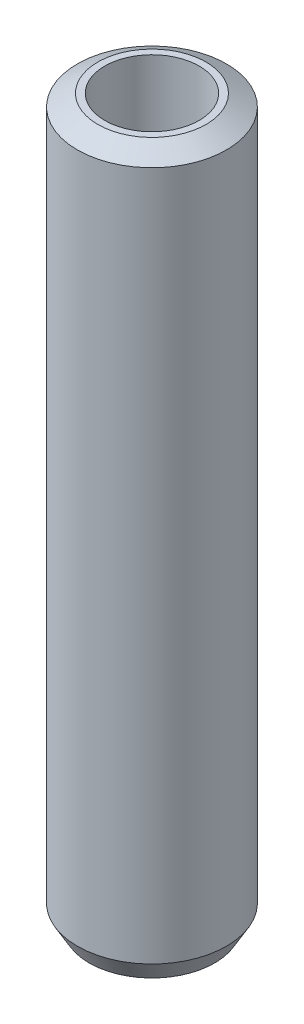
ISO-10303-21;
HEADER;
FILE_DESCRIPTION(('STEP AP214'),'2;1');
FILE_NAME('part.step','',(''),(''),'','','');
FILE_SCHEMA(('AUTOMOTIVE_DESIGN { 1 0 10303 214 1 1 1 1 }'));
ENDSEC;
DATA;
#1=APPLICATION_CONTEXT('core data for automotive mechanical design processes');
#2=APPLICATION_PROTOCOL_DEFINITION('international standard','automotive_design',2000,#1);
#3=PRODUCT_CONTEXT('',#1,'mechanical');
#4=PRODUCT('Part','Part','',(#3));
#5=PRODUCT_RELATED_PRODUCT_CATEGORY('part','',(#4));
#6=PRODUCT_DEFINITION_FORMATION('','',#4);
#7=PRODUCT_DEFINITION_CONTEXT('part definition',#1,'design');
#8=PRODUCT_DEFINITION('design','',#6,#7);
#9=PRODUCT_DEFINITION_SHAPE('','',#8);
#10=(LENGTH_UNIT() NAMED_UNIT(*) SI_UNIT(.MILLI.,.METRE.));
#11=(NAMED_UNIT(*) PLANE_ANGLE_UNIT() SI_UNIT($,.RADIAN.));
#12=(NAMED_UNIT(*) SI_UNIT($,.STERADIAN.) SOLID_ANGLE_UNIT());
#13=UNCERTAINTY_MEASURE_WITH_UNIT(LENGTH_MEASURE(1.E-05),#10,'distance_accuracy_value','');
#14=(GEOMETRIC_REPRESENTATION_CONTEXT(3) GLOBAL_UNCERTAINTY_ASSIGNED_CONTEXT((#13)) GLOBAL_UNIT_ASSIGNED_CONTEXT((#10,
#11,#12)) REPRESENTATION_CONTEXT('',''));
#15=CARTESIAN_POINT('',(0.,0.,0.));
#16=DIRECTION('',(0.,0.,1.));
#17=DIRECTION('',(1.,0.,0.));
#18=AXIS2_PLACEMENT_3D('',#15,#16,#17);
#19=CARTESIAN_POINT('',(0.,217.803175001456,0.));
#20=DIRECTION('',(0.,-1.,0.));
#21=DIRECTION('',(0.,0.,-1.));
#22=AXIS2_PLACEMENT_3D('',#19,#20,#21);
#23=CYLINDRICAL_SURFACE('',#22,22.5);
#24=CARTESIAN_POINT('',(0.,214.238775791943,0.));
#25=DIRECTION('',(0.,1.,0.));
#26=DIRECTION('',(0.,0.,1.));
#27=AXIS2_PLACEMENT_3D('',#24,#25,#26);
#28=CIRCLE('',#27,22.5);
#29=CARTESIAN_POINT('',(0.,214.238775791943,22.5));
#30=VERTEX_POINT('',#29);
#31=EDGE_CURVE('E50',#30,#30,#28,.F.);
#32=ORIENTED_EDGE('',*,*,#31,.T.);
#33=EDGE_LOOP('',(#32));
#34=FACE_BOUND('',#33,.T.);
#35=CARTESIAN_POINT('',(0.,6.17372052933607,0.));
#36=DIRECTION('',(0.,1.,0.));
#37=DIRECTION('',(0.,0.,1.));
#38=AXIS2_PLACEMENT_3D('',#35,#36,#37);
#39=CIRCLE('',#38,22.5);
#40=CARTESIAN_POINT('',(0.,6.17372052933607,22.5));
#41=VERTEX_POINT('',#40);
#42=EDGE_CURVE('E51',#41,#41,#39,.T.);
#43=ORIENTED_EDGE('',*,*,#42,.T.);
#44=EDGE_LOOP('',(#43));
#45=FACE_BOUND('',#44,.T.);
#46=ADVANCED_FACE('F39',(#34,#45),#23,.T.);
#47=CARTESIAN_POINT('',(0.,217.803175001456,0.));
#48=DIRECTION('',(0.,1.,0.));
#49=DIRECTION('',(0.,0.,1.));
#50=AXIS2_PLACEMENT_3D('',#47,#48,#49);
#51=PLANE('',#50);
#52=CARTESIAN_POINT('',(0.,217.803175001456,0.));
#53=DIRECTION('',(0.,1.,0.));
#54=DIRECTION('',(0.,0.,1.));
#55=AXIS2_PLACEMENT_3D('',#52,#53,#54);
#56=CIRCLE('',#55,16.326279470664);
#57=CARTESIAN_POINT('',(0.,217.803175001456,16.326279470664));
#58=VERTEX_POINT('',#57);
#59=EDGE_CURVE('E54',#58,#58,#56,.T.);
#60=ORIENTED_EDGE('',*,*,#59,.T.);
#61=EDGE_LOOP('',(#60));
#62=FACE_BOUND('',#61,.T.);
#63=CARTESIAN_POINT('',(0.,217.803175001456,0.));
#64=DIRECTION('',(0.,1.,0.));
#65=DIRECTION('',(0.,0.,1.));
#66=AXIS2_PLACEMENT_3D('',#63,#64,#65);
#67=CIRCLE('',#66,14.2385002283434);
#68=CARTESIAN_POINT('',(0.,217.803175001456,14.2385002283434));
#69=VERTEX_POINT('',#68);
#70=EDGE_CURVE('E58',#69,#69,#67,.T.);
#71=ORIENTED_EDGE('',*,*,#70,.F.);
#72=EDGE_LOOP('',(#71));
#73=FACE_BOUND('',#72,.T.);
#74=ADVANCED_FACE('F69',(#62,#73),#51,.T.);
#75=CARTESIAN_POINT('',(0.,0.,0.));
#76=DIRECTION('',(0.,1.,0.));
#77=DIRECTION('',(0.,0.,1.));
#78=AXIS2_PLACEMENT_3D('',#75,#76,#77);
#79=PLANE('',#78);
#80=CARTESIAN_POINT('',(0.,0.,0.));
#81=DIRECTION('',(0.,1.,0.));
#82=DIRECTION('',(0.,0.,1.));
#83=AXIS2_PLACEMENT_3D('',#80,#81,#82);
#84=CIRCLE('',#83,18.9356007904863);
#85=CARTESIAN_POINT('',(0.,0.,18.9356007904863));
#86=VERTEX_POINT('',#85);
#87=EDGE_CURVE('E10',#86,#86,#84,.F.);
#88=ORIENTED_EDGE('',*,*,#87,.T.);
#89=EDGE_LOOP('',(#88));
#90=FACE_BOUND('',#89,.T.);
#91=CARTESIAN_POINT('',(0.,0.,0.));
#92=DIRECTION('',(0.,1.,0.));
#93=DIRECTION('',(0.,0.,1.));
#94=AXIS2_PLACEMENT_3D('',#91,#92,#93);
#95=CIRCLE('',#94,14.2385002283434);
#96=CARTESIAN_POINT('',(0.,0.,14.2385002283434));
#97=VERTEX_POINT('',#96);
#98=EDGE_CURVE('E63',#97,#97,#95,.T.);
#99=ORIENTED_EDGE('',*,*,#98,.T.);
#100=EDGE_LOOP('',(#99));
#101=FACE_BOUND('',#100,.T.);
#102=ADVANCED_FACE('F75',(#90,#101),#79,.F.);
#103=CARTESIAN_POINT('',(0.,217.803175001456,0.));
#104=DIRECTION('',(0.,-1.,0.));
#105=DIRECTION('',(0.,0.,-1.));
#106=AXIS2_PLACEMENT_3D('',#103,#104,#105);
#107=CYLINDRICAL_SURFACE('',#106,14.2385002283434);
#108=ORIENTED_EDGE('',*,*,#70,.T.);
#109=EDGE_LOOP('',(#108));
#110=FACE_BOUND('',#109,.T.);
#111=ORIENTED_EDGE('',*,*,#98,.F.);
#112=EDGE_LOOP('',(#111));
#113=FACE_BOUND('',#112,.T.);
#114=ADVANCED_FACE('F70',(#110,#113),#107,.F.);
#115=CARTESIAN_POINT('',(0.,217.803175001456,0.));
#116=DIRECTION('',(0.,-1.,0.));
#117=DIRECTION('',(0.,0.,-1.));
#118=AXIS2_PLACEMENT_3D('',#115,#116,#117);
#119=CONICAL_SURFACE('',#118,16.326279470664,1.04719755119659);
#120=ORIENTED_EDGE('',*,*,#31,.F.);
#121=EDGE_LOOP('',(#120));
#122=FACE_BOUND('',#121,.T.);
#123=ORIENTED_EDGE('',*,*,#59,.F.);
#124=EDGE_LOOP('',(#123));
#125=FACE_BOUND('',#124,.T.);
#126=ADVANCED_FACE('F81',(#122,#125),#119,.T.);
#127=CARTESIAN_POINT('',(0.,6.17372052933607,0.));
#128=DIRECTION('',(0.,1.,0.));
#129=DIRECTION('',(0.,0.,1.));
#130=AXIS2_PLACEMENT_3D('',#127,#128,#129);
#131=CONICAL_SURFACE('',#130,22.5,0.523598775598303);
#132=ORIENTED_EDGE('',*,*,#87,.F.);
#133=EDGE_LOOP('',(#132));
#134=FACE_BOUND('',#133,.T.);
#135=ORIENTED_EDGE('',*,*,#42,.F.);
#136=EDGE_LOOP('',(#135));
#137=FACE_BOUND('',#136,.T.);
#138=ADVANCED_FACE('F45',(#134,#137),#131,.T.);
#139=CLOSED_SHELL('',(#46,#74,#102,#114,#126,#138));
#140=MANIFOLD_SOLID_BREP('B2',#139);
#141=ADVANCED_BREP_SHAPE_REPRESENTATION('',(#18,#140),#14);
#142=SHAPE_DEFINITION_REPRESENTATION(#9,#141);
ENDSEC;
END-ISO-10303-21;
